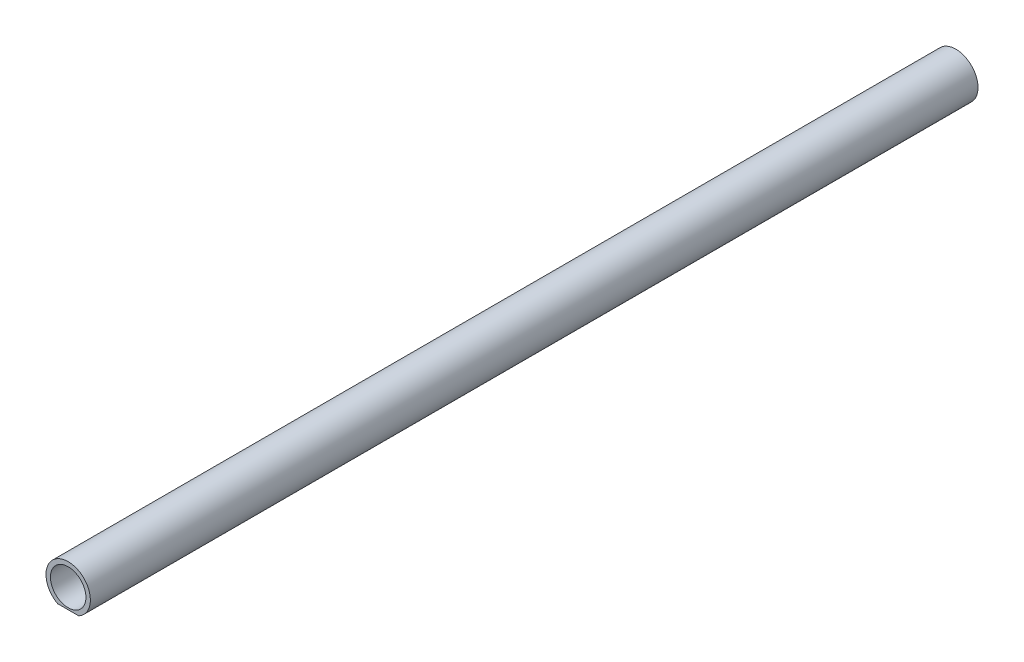
ISO-10303-21;
HEADER;
FILE_DESCRIPTION(('STEP AP214'),'2;1');
FILE_NAME('part.step','',(''),(''),'','','');
FILE_SCHEMA(('AUTOMOTIVE_DESIGN { 1 0 10303 214 1 1 1 1 }'));
ENDSEC;
DATA;
#1=APPLICATION_CONTEXT('core data for automotive mechanical design processes');
#2=APPLICATION_PROTOCOL_DEFINITION('international standard','automotive_design',2000,#1);
#3=PRODUCT_CONTEXT('',#1,'mechanical');
#4=PRODUCT('Part','Part','',(#3));
#5=PRODUCT_RELATED_PRODUCT_CATEGORY('part','',(#4));
#6=PRODUCT_DEFINITION_FORMATION('','',#4);
#7=PRODUCT_DEFINITION_CONTEXT('part definition',#1,'design');
#8=PRODUCT_DEFINITION('design','',#6,#7);
#9=PRODUCT_DEFINITION_SHAPE('','',#8);
#10=(LENGTH_UNIT() NAMED_UNIT(*) SI_UNIT(.MILLI.,.METRE.));
#11=(NAMED_UNIT(*) PLANE_ANGLE_UNIT() SI_UNIT($,.RADIAN.));
#12=(NAMED_UNIT(*) SI_UNIT($,.STERADIAN.) SOLID_ANGLE_UNIT());
#13=UNCERTAINTY_MEASURE_WITH_UNIT(LENGTH_MEASURE(1.E-05),#10,'distance_accuracy_value','');
#14=(GEOMETRIC_REPRESENTATION_CONTEXT(3) GLOBAL_UNCERTAINTY_ASSIGNED_CONTEXT((#13)) GLOBAL_UNIT_ASSIGNED_CONTEXT((#10,
#11,#12)) REPRESENTATION_CONTEXT('',''));
#15=CARTESIAN_POINT('',(0.,0.,0.));
#16=DIRECTION('',(0.,0.,1.));
#17=DIRECTION('',(1.,0.,0.));
#18=AXIS2_PLACEMENT_3D('',#15,#16,#17);
#19=CARTESIAN_POINT('',(0.,6.33813633592694,1000.));
#20=DIRECTION('',(0.,0.,1.));
#21=DIRECTION('',(1.,0.,0.));
#22=AXIS2_PLACEMENT_3D('',#19,#20,#21);
#23=PLANE('',#22);
#24=CARTESIAN_POINT('',(0.,6.33813633592694,1000.));
#25=DIRECTION('',(0.,0.,1.));
#26=DIRECTION('',(1.,0.,0.));
#27=AXIS2_PLACEMENT_3D('',#24,#25,#26);
#28=CIRCLE('',#27,25.);
#29=CARTESIAN_POINT('',(11.8743420870379,-15.6618636640731,1000.));
#30=VERTEX_POINT('',#29);
#31=CARTESIAN_POINT('',(-11.8743420870379,-15.6618636640731,1000.));
#32=VERTEX_POINT('',#31);
#33=EDGE_CURVE('E74',#30,#32,#28,.T.);
#34=ORIENTED_EDGE('',*,*,#33,.T.);
#35=DIRECTION('',(1.,0.,0.));
#36=VECTOR('',#35,1.);
#37=CARTESIAN_POINT('',(-11.8743420870379,-15.6618636640731,1000.));
#38=LINE('',#37,#36);
#39=EDGE_CURVE('E59',#32,#30,#38,.T.);
#40=ORIENTED_EDGE('',*,*,#39,.T.);
#41=EDGE_LOOP('',(#34,#40));
#42=FACE_BOUND('',#41,.T.);
#43=CARTESIAN_POINT('',(0.,6.33813633592694,1000.));
#44=DIRECTION('',(0.,0.,1.));
#45=DIRECTION('',(1.,0.,0.));
#46=AXIS2_PLACEMENT_3D('',#43,#44,#45);
#47=CIRCLE('',#46,20.);
#48=CARTESIAN_POINT('',(20.,6.33813633592694,1000.));
#49=VERTEX_POINT('',#48);
#50=EDGE_CURVE('E80',#49,#49,#47,.T.);
#51=ORIENTED_EDGE('',*,*,#50,.F.);
#52=EDGE_LOOP('',(#51));
#53=FACE_BOUND('',#52,.T.);
#54=ADVANCED_FACE('F43',(#42,#53),#23,.T.);
#55=CARTESIAN_POINT('',(0.,6.33813633592694,0.));
#56=DIRECTION('',(0.,0.,1.));
#57=DIRECTION('',(1.,0.,0.));
#58=AXIS2_PLACEMENT_3D('',#55,#56,#57);
#59=PLANE('',#58);
#60=CARTESIAN_POINT('',(0.,6.33813633592694,0.));
#61=DIRECTION('',(0.,0.,1.));
#62=DIRECTION('',(1.,0.,0.));
#63=AXIS2_PLACEMENT_3D('',#60,#61,#62);
#64=CIRCLE('',#63,25.);
#65=CARTESIAN_POINT('',(11.8743420870379,-15.6618636640731,0.));
#66=VERTEX_POINT('',#65);
#67=CARTESIAN_POINT('',(-11.8743420870379,-15.6618636640731,0.));
#68=VERTEX_POINT('',#67);
#69=EDGE_CURVE('E75',#66,#68,#64,.T.);
#70=ORIENTED_EDGE('',*,*,#69,.F.);
#71=DIRECTION('',(1.,0.,0.));
#72=VECTOR('',#71,1.);
#73=CARTESIAN_POINT('',(-11.8743420870379,-15.6618636640731,0.));
#74=LINE('',#73,#72);
#75=EDGE_CURVE('E67',#68,#66,#74,.T.);
#76=ORIENTED_EDGE('',*,*,#75,.F.);
#77=EDGE_LOOP('',(#70,#76));
#78=FACE_BOUND('',#77,.T.);
#79=CARTESIAN_POINT('',(0.,6.33813633592694,0.));
#80=DIRECTION('',(0.,0.,1.));
#81=DIRECTION('',(1.,0.,0.));
#82=AXIS2_PLACEMENT_3D('',#79,#80,#81);
#83=CIRCLE('',#82,20.);
#84=CARTESIAN_POINT('',(20.,6.33813633592694,0.));
#85=VERTEX_POINT('',#84);
#86=EDGE_CURVE('E83',#85,#85,#83,.T.);
#87=ORIENTED_EDGE('',*,*,#86,.T.);
#88=EDGE_LOOP('',(#87));
#89=FACE_BOUND('',#88,.T.);
#90=ADVANCED_FACE('F78',(#78,#89),#59,.F.);
#91=CARTESIAN_POINT('',(0.,6.33813633592694,1000.));
#92=DIRECTION('',(0.,0.,-1.));
#93=DIRECTION('',(-1.,0.,0.));
#94=AXIS2_PLACEMENT_3D('',#91,#92,#93);
#95=CYLINDRICAL_SURFACE('',#94,25.);
#96=ORIENTED_EDGE('',*,*,#69,.T.);
#97=DIRECTION('',(0.,0.,-1.));
#98=VECTOR('',#97,1.);
#99=CARTESIAN_POINT('',(-11.8743420870379,-15.6618636640731,1000.));
#100=LINE('',#99,#98);
#101=EDGE_CURVE('E11',#32,#68,#100,.T.);
#102=ORIENTED_EDGE('',*,*,#101,.F.);
#103=ORIENTED_EDGE('',*,*,#33,.F.);
#104=DIRECTION('',(0.,0.,-1.));
#105=VECTOR('',#104,1.);
#106=CARTESIAN_POINT('',(11.8743420870379,-15.6618636640731,1000.));
#107=LINE('',#106,#105);
#108=EDGE_CURVE('E52',#30,#66,#107,.T.);
#109=ORIENTED_EDGE('',*,*,#108,.T.);
#110=EDGE_LOOP('',(#96,#102,#103,#109));
#111=FACE_BOUND('',#110,.T.);
#112=ADVANCED_FACE('F45',(#111),#95,.T.);
#113=CARTESIAN_POINT('',(-11.8743420870379,-15.6618636640731,1000.));
#114=DIRECTION('',(0.,1.,0.));
#115=DIRECTION('',(0.,0.,1.));
#116=AXIS2_PLACEMENT_3D('',#113,#114,#115);
#117=PLANE('',#116);
#118=ORIENTED_EDGE('',*,*,#75,.T.);
#119=ORIENTED_EDGE('',*,*,#108,.F.);
#120=ORIENTED_EDGE('',*,*,#39,.F.);
#121=ORIENTED_EDGE('',*,*,#101,.T.);
#122=EDGE_LOOP('',(#118,#119,#120,#121));
#123=FACE_BOUND('',#122,.T.);
#124=ADVANCED_FACE('F70',(#123),#117,.F.);
#125=CARTESIAN_POINT('',(0.,6.33813633592694,1000.));
#126=DIRECTION('',(0.,0.,-1.));
#127=DIRECTION('',(-1.,0.,0.));
#128=AXIS2_PLACEMENT_3D('',#125,#126,#127);
#129=CYLINDRICAL_SURFACE('',#128,20.);
#130=ORIENTED_EDGE('',*,*,#50,.T.);
#131=EDGE_LOOP('',(#130));
#132=FACE_BOUND('',#131,.T.);
#133=ORIENTED_EDGE('',*,*,#86,.F.);
#134=EDGE_LOOP('',(#133));
#135=FACE_BOUND('',#134,.T.);
#136=ADVANCED_FACE('F91',(#132,#135),#129,.F.);
#137=CLOSED_SHELL('',(#54,#90,#112,#124,#136));
#138=MANIFOLD_SOLID_BREP('B2',#137);
#139=ADVANCED_BREP_SHAPE_REPRESENTATION('',(#18,#138),#14);
#140=SHAPE_DEFINITION_REPRESENTATION(#9,#139);
ENDSEC;
END-ISO-10303-21;
